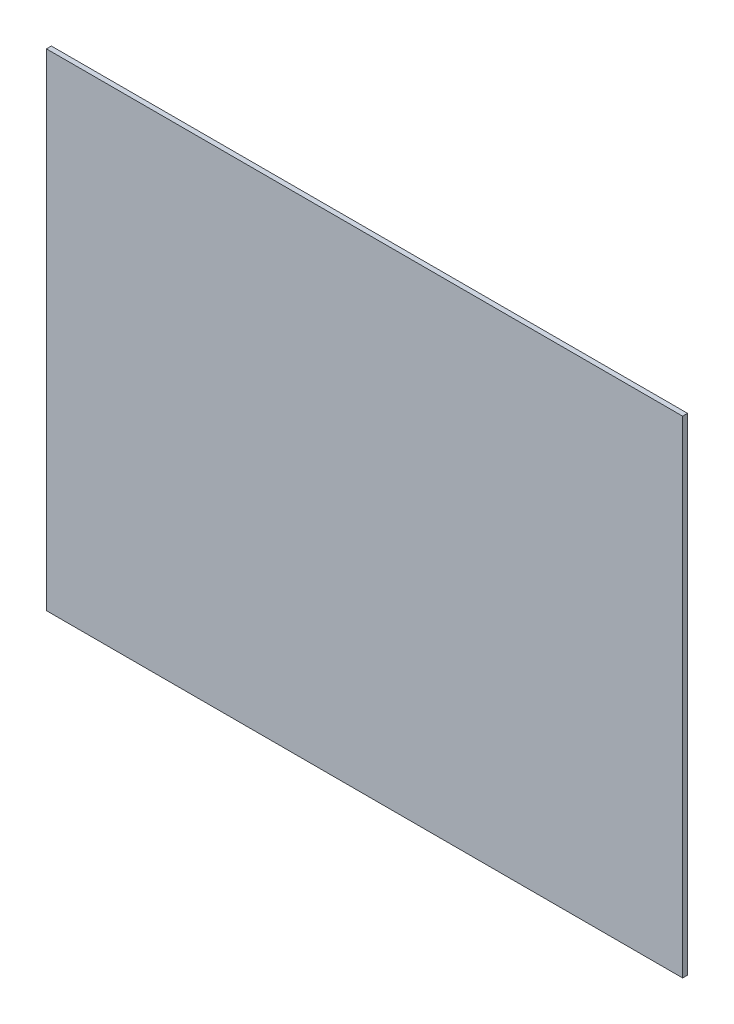
ISO-10303-21;
HEADER;
FILE_DESCRIPTION(('STEP AP214'),'2;1');
FILE_NAME('part.step','',(''),(''),'','','');
FILE_SCHEMA(('AUTOMOTIVE_DESIGN { 1 0 10303 214 1 1 1 1 }'));
ENDSEC;
DATA;
#1=APPLICATION_CONTEXT('core data for automotive mechanical design processes');
#2=APPLICATION_PROTOCOL_DEFINITION('international standard','automotive_design',2000,#1);
#3=PRODUCT_CONTEXT('',#1,'mechanical');
#4=PRODUCT('Part','Part','',(#3));
#5=PRODUCT_RELATED_PRODUCT_CATEGORY('part','',(#4));
#6=PRODUCT_DEFINITION_FORMATION('','',#4);
#7=PRODUCT_DEFINITION_CONTEXT('part definition',#1,'design');
#8=PRODUCT_DEFINITION('design','',#6,#7);
#9=PRODUCT_DEFINITION_SHAPE('','',#8);
#10=(LENGTH_UNIT() NAMED_UNIT(*) SI_UNIT(.MILLI.,.METRE.));
#11=(NAMED_UNIT(*) PLANE_ANGLE_UNIT() SI_UNIT($,.RADIAN.));
#12=(NAMED_UNIT(*) SI_UNIT($,.STERADIAN.) SOLID_ANGLE_UNIT());
#13=UNCERTAINTY_MEASURE_WITH_UNIT(LENGTH_MEASURE(1.E-05),#10,'distance_accuracy_value','');
#14=(GEOMETRIC_REPRESENTATION_CONTEXT(3) GLOBAL_UNCERTAINTY_ASSIGNED_CONTEXT((#13)) GLOBAL_UNIT_ASSIGNED_CONTEXT((#10,
#11,#12)) REPRESENTATION_CONTEXT('',''));
#15=CARTESIAN_POINT('',(0.,0.,0.));
#16=DIRECTION('',(0.,0.,1.));
#17=DIRECTION('',(1.,0.,0.));
#18=AXIS2_PLACEMENT_3D('',#15,#16,#17);
#19=CARTESIAN_POINT('',(-0.0100000000000378,107.5,-39.));
#20=DIRECTION('',(0.,0.,1.));
#21=DIRECTION('',(0.,-1.,0.));
#22=AXIS2_PLACEMENT_3D('',#19,#20,#21);
#23=PLANE('',#22);
#24=DIRECTION('',(0.,-1.,0.));
#25=VECTOR('',#24,1.);
#26=CARTESIAN_POINT('',(165.,107.5,-39.));
#27=LINE('',#26,#25);
#28=CARTESIAN_POINT('',(165.,107.5,-39.));
#29=VERTEX_POINT('',#28);
#30=CARTESIAN_POINT('',(165.,8.50000000000001,-39.));
#31=VERTEX_POINT('',#30);
#32=EDGE_CURVE('E11',#29,#31,#27,.T.);
#33=ORIENTED_EDGE('',*,*,#32,.F.);
#34=DIRECTION('',(1.,0.,0.));
#35=VECTOR('',#34,1.);
#36=CARTESIAN_POINT('',(165.,107.5,-39.));
#37=LINE('',#36,#35);
#38=CARTESIAN_POINT('',(35.5503363687331,107.5,-39.));
#39=VERTEX_POINT('',#38);
#40=EDGE_CURVE('E85',#39,#29,#37,.T.);
#41=ORIENTED_EDGE('',*,*,#40,.F.);
#42=DIRECTION('',(0.,1.,0.));
#43=VECTOR('',#42,1.);
#44=CARTESIAN_POINT('',(35.5503363687331,107.5,-39.));
#45=LINE('',#44,#43);
#46=CARTESIAN_POINT('',(35.550336368733,8.50000000000001,-39.));
#47=VERTEX_POINT('',#46);
#48=EDGE_CURVE('E81',#47,#39,#45,.T.);
#49=ORIENTED_EDGE('',*,*,#48,.F.);
#50=DIRECTION('',(-1.,0.,0.));
#51=VECTOR('',#50,1.);
#52=CARTESIAN_POINT('',(165.,8.50000000000001,-39.));
#53=LINE('',#52,#51);
#54=EDGE_CURVE('E46',#31,#47,#53,.T.);
#55=ORIENTED_EDGE('',*,*,#54,.F.);
#56=EDGE_LOOP('',(#33,#41,#49,#55));
#57=FACE_BOUND('',#56,.T.);
#58=ADVANCED_FACE('F37',(#57),#23,.T.);
#59=CARTESIAN_POINT('',(35.5503363687331,107.5,-39.));
#60=DIRECTION('',(1.,0.,0.));
#61=DIRECTION('',(0.,1.,0.));
#62=AXIS2_PLACEMENT_3D('',#59,#60,#61);
#63=PLANE('',#62);
#64=ORIENTED_EDGE('',*,*,#48,.T.);
#65=DIRECTION('',(0.,0.,1.));
#66=VECTOR('',#65,1.);
#67=CARTESIAN_POINT('',(35.5503363687331,107.5,-39.));
#68=LINE('',#67,#66);
#69=CARTESIAN_POINT('',(35.5503363687331,107.5,-40.));
#70=VERTEX_POINT('',#69);
#71=EDGE_CURVE('E93',#70,#39,#68,.T.);
#72=ORIENTED_EDGE('',*,*,#71,.F.);
#73=DIRECTION('',(0.,1.,0.));
#74=VECTOR('',#73,1.);
#75=CARTESIAN_POINT('',(35.5503363687331,107.5,-40.));
#76=LINE('',#75,#74);
#77=CARTESIAN_POINT('',(35.550336368733,8.50000000000001,-40.));
#78=VERTEX_POINT('',#77);
#79=EDGE_CURVE('E92',#78,#70,#76,.T.);
#80=ORIENTED_EDGE('',*,*,#79,.F.);
#81=DIRECTION('',(0.,0.,1.));
#82=VECTOR('',#81,1.);
#83=CARTESIAN_POINT('',(35.550336368733,8.50000000000001,-39.));
#84=LINE('',#83,#82);
#85=EDGE_CURVE('E60',#78,#47,#84,.T.);
#86=ORIENTED_EDGE('',*,*,#85,.T.);
#87=EDGE_LOOP('',(#64,#72,#80,#86));
#88=FACE_BOUND('',#87,.T.);
#89=ADVANCED_FACE('F90',(#88),#63,.F.);
#90=CARTESIAN_POINT('',(0.,0.,-40.));
#91=DIRECTION('',(0.,0.,-1.));
#92=DIRECTION('',(-1.,0.,0.));
#93=AXIS2_PLACEMENT_3D('',#90,#91,#92);
#94=PLANE('',#93);
#95=DIRECTION('',(0.,-1.,0.));
#96=VECTOR('',#95,1.);
#97=CARTESIAN_POINT('',(165.,107.5,-40.));
#98=LINE('',#97,#96);
#99=CARTESIAN_POINT('',(165.,107.5,-40.));
#100=VERTEX_POINT('',#99);
#101=CARTESIAN_POINT('',(165.,8.50000000000001,-40.));
#102=VERTEX_POINT('',#101);
#103=EDGE_CURVE('E97',#100,#102,#98,.T.);
#104=ORIENTED_EDGE('',*,*,#103,.T.);
#105=DIRECTION('',(-1.,0.,0.));
#106=VECTOR('',#105,1.);
#107=CARTESIAN_POINT('',(165.,8.50000000000001,-40.));
#108=LINE('',#107,#106);
#109=EDGE_CURVE('E100',#102,#78,#108,.T.);
#110=ORIENTED_EDGE('',*,*,#109,.T.);
#111=ORIENTED_EDGE('',*,*,#79,.T.);
#112=DIRECTION('',(1.,0.,0.));
#113=VECTOR('',#112,1.);
#114=CARTESIAN_POINT('',(165.,107.5,-40.));
#115=LINE('',#114,#113);
#116=EDGE_CURVE('E103',#70,#100,#115,.T.);
#117=ORIENTED_EDGE('',*,*,#116,.T.);
#118=EDGE_LOOP('',(#104,#110,#111,#117));
#119=FACE_BOUND('',#118,.T.);
#120=ADVANCED_FACE('F111',(#119),#94,.T.);
#121=CARTESIAN_POINT('',(165.,0.,4.));
#122=DIRECTION('',(1.,0.,0.));
#123=DIRECTION('',(0.,0.,-1.));
#124=AXIS2_PLACEMENT_3D('',#121,#122,#123);
#125=PLANE('',#124);
#126=DIRECTION('',(0.,0.,1.));
#127=VECTOR('',#126,1.);
#128=CARTESIAN_POINT('',(165.,107.5,-39.));
#129=LINE('',#128,#127);
#130=EDGE_CURVE('E41',#100,#29,#129,.T.);
#131=ORIENTED_EDGE('',*,*,#130,.T.);
#132=ORIENTED_EDGE('',*,*,#32,.T.);
#133=DIRECTION('',(0.,0.,1.));
#134=VECTOR('',#133,1.);
#135=CARTESIAN_POINT('',(165.,8.50000000000001,-39.));
#136=LINE('',#135,#134);
#137=EDGE_CURVE('E53',#102,#31,#136,.T.);
#138=ORIENTED_EDGE('',*,*,#137,.F.);
#139=ORIENTED_EDGE('',*,*,#103,.F.);
#140=EDGE_LOOP('',(#131,#132,#138,#139));
#141=FACE_BOUND('',#140,.T.);
#142=ADVANCED_FACE('F39',(#141),#125,.T.);
#143=CARTESIAN_POINT('',(35.5503363687331,107.5,-39.));
#144=DIRECTION('',(0.,-1.,0.));
#145=DIRECTION('',(0.,0.,-1.));
#146=AXIS2_PLACEMENT_3D('',#143,#144,#145);
#147=PLANE('',#146);
#148=ORIENTED_EDGE('',*,*,#40,.T.);
#149=ORIENTED_EDGE('',*,*,#130,.F.);
#150=ORIENTED_EDGE('',*,*,#116,.F.);
#151=ORIENTED_EDGE('',*,*,#71,.T.);
#152=EDGE_LOOP('',(#148,#149,#150,#151));
#153=FACE_BOUND('',#152,.T.);
#154=ADVANCED_FACE('F108',(#153),#147,.F.);
#155=CARTESIAN_POINT('',(35.550336368733,8.50000000000001,-39.));
#156=DIRECTION('',(0.,1.,0.));
#157=DIRECTION('',(0.,0.,1.));
#158=AXIS2_PLACEMENT_3D('',#155,#156,#157);
#159=PLANE('',#158);
#160=ORIENTED_EDGE('',*,*,#54,.T.);
#161=ORIENTED_EDGE('',*,*,#85,.F.);
#162=ORIENTED_EDGE('',*,*,#109,.F.);
#163=ORIENTED_EDGE('',*,*,#137,.T.);
#164=EDGE_LOOP('',(#160,#161,#162,#163));
#165=FACE_BOUND('',#164,.T.);
#166=ADVANCED_FACE('F79',(#165),#159,.F.);
#167=CLOSED_SHELL('',(#58,#89,#120,#142,#154,#166));
#168=MANIFOLD_SOLID_BREP('B2',#167);
#169=ADVANCED_BREP_SHAPE_REPRESENTATION('',(#18,#168),#14);
#170=SHAPE_DEFINITION_REPRESENTATION(#9,#169);
ENDSEC;
END-ISO-10303-21;
